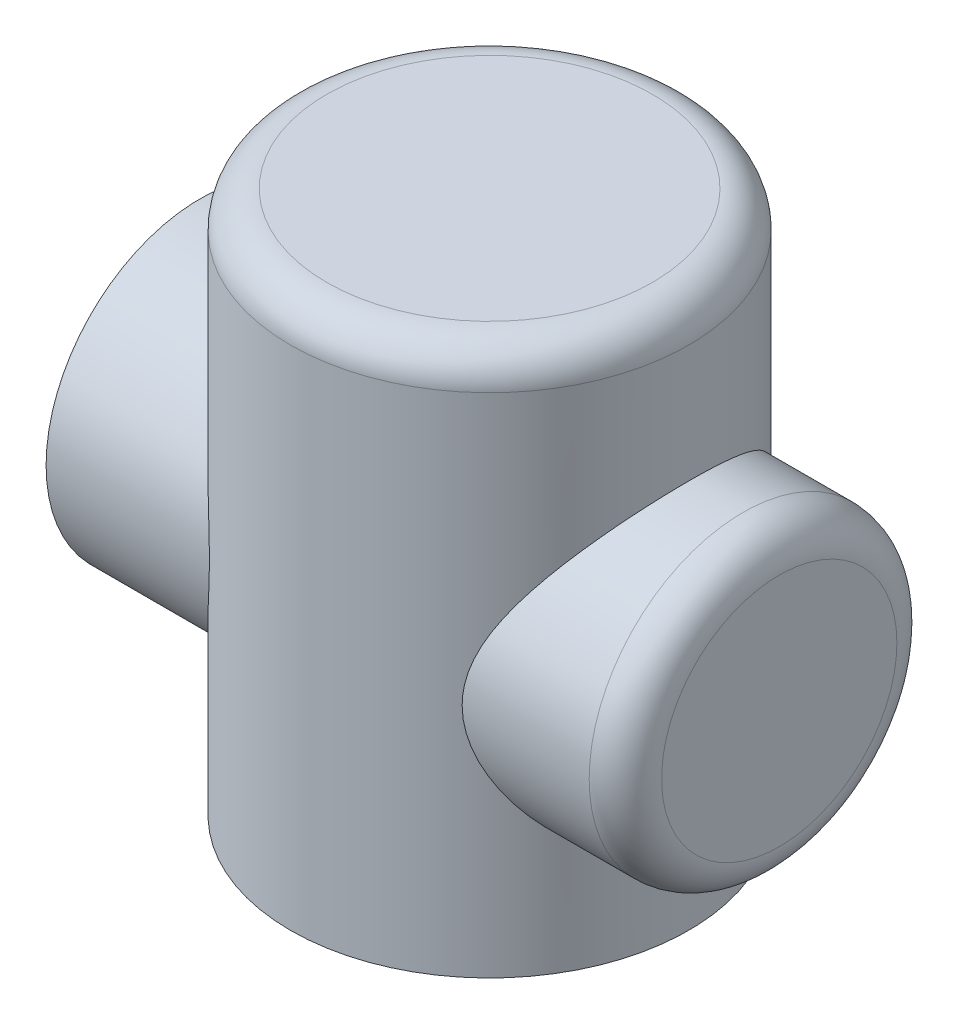
ISO-10303-21;
HEADER;
FILE_DESCRIPTION(('STEP AP214'),'2;1');
FILE_NAME('part.step','',(''),(''),'','','');
FILE_SCHEMA(('AUTOMOTIVE_DESIGN { 1 0 10303 214 1 1 1 1 }'));
ENDSEC;
DATA;
#1=APPLICATION_CONTEXT('core data for automotive mechanical design processes');
#2=APPLICATION_PROTOCOL_DEFINITION('international standard','automotive_design',2000,#1);
#3=PRODUCT_CONTEXT('',#1,'mechanical');
#4=PRODUCT('Part','Part','',(#3));
#5=PRODUCT_RELATED_PRODUCT_CATEGORY('part','',(#4));
#6=PRODUCT_DEFINITION_FORMATION('','',#4);
#7=PRODUCT_DEFINITION_CONTEXT('part definition',#1,'design');
#8=PRODUCT_DEFINITION('design','',#6,#7);
#9=PRODUCT_DEFINITION_SHAPE('','',#8);
#10=(LENGTH_UNIT() NAMED_UNIT(*) SI_UNIT(.MILLI.,.METRE.));
#11=(NAMED_UNIT(*) PLANE_ANGLE_UNIT() SI_UNIT($,.RADIAN.));
#12=(NAMED_UNIT(*) SI_UNIT($,.STERADIAN.) SOLID_ANGLE_UNIT());
#13=UNCERTAINTY_MEASURE_WITH_UNIT(LENGTH_MEASURE(1.E-05),#10,'distance_accuracy_value','');
#14=(GEOMETRIC_REPRESENTATION_CONTEXT(3) GLOBAL_UNCERTAINTY_ASSIGNED_CONTEXT((#13)) GLOBAL_UNIT_ASSIGNED_CONTEXT((#10,
#11,#12)) REPRESENTATION_CONTEXT('',''));
#15=CARTESIAN_POINT('',(0.,0.,0.));
#16=DIRECTION('',(0.,0.,1.));
#17=DIRECTION('',(1.,0.,0.));
#18=AXIS2_PLACEMENT_3D('',#15,#16,#17);
#19=CARTESIAN_POINT('',(0.,150.,0.));
#20=DIRECTION('',(0.,-1.,0.));
#21=DIRECTION('',(0.,0.,-1.));
#22=AXIS2_PLACEMENT_3D('',#19,#20,#21);
#23=CYLINDRICAL_SURFACE('',#22,55.);
#24=CARTESIAN_POINT('',(0.,140.,0.));
#25=DIRECTION('',(0.,1.,0.));
#26=DIRECTION('',(0.,0.,1.));
#27=AXIS2_PLACEMENT_3D('',#24,#25,#26);
#28=CIRCLE('',#27,55.);
#29=CARTESIAN_POINT('',(0.,140.,55.));
#30=VERTEX_POINT('',#29);
#31=EDGE_CURVE('E74',#30,#30,#28,.F.);
#32=ORIENTED_EDGE('',*,*,#31,.T.);
#33=EDGE_LOOP('',(#32));
#34=FACE_BOUND('',#33,.T.);
#35=CARTESIAN_POINT('',(0.,0.,0.));
#36=DIRECTION('',(0.,1.,0.));
#37=DIRECTION('',(0.,0.,1.));
#38=AXIS2_PLACEMENT_3D('',#35,#36,#37);
#39=CIRCLE('',#38,55.);
#40=CARTESIAN_POINT('',(0.,0.,55.));
#41=VERTEX_POINT('',#40);
#42=EDGE_CURVE('E118',#41,#41,#39,.T.);
#43=ORIENTED_EDGE('',*,*,#42,.T.);
#44=EDGE_LOOP('',(#43));
#45=FACE_BOUND('',#44,.T.);
#46=CARTESIAN_POINT('',(-34.9106001094223,65.,42.5));
#47=CARTESIAN_POINT('',(-34.9105997851786,65.4891449843264,42.5000002288912));
#48=CARTESIAN_POINT('',(-34.9208955316221,65.9782939303529,42.4915493792357));
#49=CARTESIAN_POINT('',(-34.9619001599965,66.9551568815526,42.457817106543));
#50=CARTESIAN_POINT('',(-34.9926095770876,67.44287084877,42.4325352422677));
#51=CARTESIAN_POINT('',(-35.0739342720024,68.4155049460207,42.3653387466732));
#52=CARTESIAN_POINT('',(-35.1245502921923,68.9004249711767,42.3234234950536));
#53=CARTESIAN_POINT('',(-35.2448610571616,69.8662194110095,42.2232851714191));
#54=CARTESIAN_POINT('',(-35.3145586980467,70.3470932001417,42.1650596238841));
#55=CARTESIAN_POINT('',(-35.5512536730363,71.7849782019962,41.9660754884727));
#56=CARTESIAN_POINT('',(-35.7456011158555,72.7343580064285,41.8012124811986));
#57=CARTESIAN_POINT('',(-36.1964682107257,74.605230788093,41.4113987075601));
#58=CARTESIAN_POINT('',(-36.4529977494698,75.526719304493,41.1864383853928));
#59=CARTESIAN_POINT('',(-37.077660706149,77.5339047626655,40.625839626523));
#60=CARTESIAN_POINT('',(-37.4579319519364,78.6120680336423,40.2767899053382));
#61=CARTESIAN_POINT('',(-38.2737974254088,80.7187150287624,39.502312406044));
#62=CARTESIAN_POINT('',(-38.7094081628024,81.7471838003834,39.0768618191511));
#63=CARTESIAN_POINT('',(-39.6192021057817,83.7545230170705,38.1541475858732));
#64=CARTESIAN_POINT('',(-40.0934161782856,84.7333527358697,37.6568262209241));
#65=CARTESIAN_POINT('',(-41.0656968927172,86.6405718331285,36.5940886947428));
#66=CARTESIAN_POINT('',(-41.5637612823182,87.5689659569154,36.0286789558901));
#67=CARTESIAN_POINT('',(-42.5849452621606,89.3991636008043,34.8161911063448));
#68=CARTESIAN_POINT('',(-43.1083793188185,90.2996270102167,34.1673571583866));
#69=CARTESIAN_POINT('',(-44.1564155957314,92.0467618949143,32.8017071071619));
#70=CARTESIAN_POINT('',(-44.6810178587349,92.8934313670834,32.0848884748354));
#71=CARTESIAN_POINT('',(-45.7209427029055,94.5305572948476,30.5847654803963));
#72=CARTESIAN_POINT('',(-46.2362713509327,95.3210515789884,29.8015066541491));
#73=CARTESIAN_POINT('',(-47.2486214887345,96.8434494585851,28.1689583325873));
#74=CARTESIAN_POINT('',(-47.7456440580623,97.575356512066,27.3196727402465));
#75=CARTESIAN_POINT('',(-48.6912095230291,98.945822343589,25.594741173882));
#76=CARTESIAN_POINT('',(-49.1409219510165,99.5870634828419,24.72187161527));
#77=CARTESIAN_POINT('',(-50.007535260636,100.807656258381,22.9182735623926));
#78=CARTESIAN_POINT('',(-50.4244356490151,101.387006964334,21.9875441987151));
#79=CARTESIAN_POINT('',(-51.217301799851,102.47802394852,20.0714287908287));
#80=CARTESIAN_POINT('',(-51.5932953912362,102.98973629277,19.0860806014535));
#81=CARTESIAN_POINT('',(-52.2968713559347,103.939885744194,17.0640681321183));
#82=CARTESIAN_POINT('',(-52.6244618743697,104.378335181457,16.0274125252987));
#83=CARTESIAN_POINT('',(-53.1783562571218,105.11529948507,14.0689559091465));
#84=CARTESIAN_POINT('',(-53.4124861195881,105.424951071134,13.1535489443157));
#85=CARTESIAN_POINT('',(-53.8363088428573,105.983304166828,11.2942726185532));
#86=CARTESIAN_POINT('',(-54.026005923523,106.232011464553,10.3504059701077));
#87=CARTESIAN_POINT('',(-54.3571797125297,106.665002526401,8.440152075847));
#88=CARTESIAN_POINT('',(-54.4986801770982,106.849318030548,7.47377617658783));
#89=CARTESIAN_POINT('',(-54.730640675359,107.150947051705,5.52451086864479));
#90=CARTESIAN_POINT('',(-54.8211001312332,107.2682598102,4.54162127314463));
#91=CARTESIAN_POINT('',(-54.9491808198944,107.434246529204,2.5636885701714));
#92=CARTESIAN_POINT('',(-54.9866459443309,107.482717700921,1.56861822921809));
#93=CARTESIAN_POINT('',(-55.0073886621494,107.509562236798,-0.423039341332993));
#94=CARTESIAN_POINT('',(-54.9906661455108,107.487935458632,-1.41962657400649));
#95=CARTESIAN_POINT('',(-54.9034096745232,107.374941585768,-3.40656238673648));
#96=CARTESIAN_POINT('',(-54.8328694358445,107.283566346495,-4.39691022459699));
#97=CARTESIAN_POINT('',(-54.6395432558043,107.03255987222,-6.36370590413459));
#98=CARTESIAN_POINT('',(-54.5167580591416,106.872929610124,-7.34015394373414));
#99=CARTESIAN_POINT('',(-54.2280279248772,106.496300395108,-9.2301000257284));
#100=CARTESIAN_POINT('',(-54.0641998867619,106.282108450803,-10.1444857875692));
#101=CARTESIAN_POINT('',(-53.6942155727445,105.796366817344,-11.9490403604779));
#102=CARTESIAN_POINT('',(-53.4880608533747,105.52481923739,-12.8392100607105));
#103=CARTESIAN_POINT('',(-53.0369496202634,104.927513584394,-14.5911042584072));
#104=CARTESIAN_POINT('',(-52.791989029187,104.60174981467,-15.4528257553072));
#105=CARTESIAN_POINT('',(-52.2671744266677,103.899382827112,-17.1442933501702));
#106=CARTESIAN_POINT('',(-51.9873183365002,103.522776580481,-17.9740375393873));
#107=CARTESIAN_POINT('',(-51.3659386528833,102.680219038676,-19.6837958371438));
#108=CARTESIAN_POINT('',(-51.0210269275216,102.209043899619,-20.5600030565746));
#109=CARTESIAN_POINT('',(-50.299264721007,101.213033840974,-22.2675406540159));
#110=CARTESIAN_POINT('',(-49.9224123726884,100.688195784022,-23.0988684038329));
#111=CARTESIAN_POINT('',(-49.1422236946961,99.5884156820301,-24.7153332647529));
#112=CARTESIAN_POINT('',(-48.7388726133643,99.0134456696104,-25.5004441782203));
#113=CARTESIAN_POINT('',(-47.9115579848606,97.8169795483925,-27.0228293792587));
#114=CARTESIAN_POINT('',(-47.487593462658,97.19548123802,-27.7601014001569));
#115=CARTESIAN_POINT('',(-46.5373693848213,95.7783477350251,-29.3304821825735));
#116=CARTESIAN_POINT('',(-46.0077784030319,94.9729330412174,-30.1527706068329));
#117=CARTESIAN_POINT('',(-44.9372175215653,93.3022098910415,-31.7262057612385));
#118=CARTESIAN_POINT('',(-44.3962455616245,92.4368905242271,-32.477339472655));
#119=CARTESIAN_POINT('',(-43.3135022961492,90.6479460113039,-33.9079008374094));
#120=CARTESIAN_POINT('',(-42.7717306980876,89.7242741971617,-34.5872699056561));
#121=CARTESIAN_POINT('',(-41.7001287343741,87.8203893907003,-35.8719733800113));
#122=CARTESIAN_POINT('',(-41.170296237502,86.8401866025813,-36.4773210862751));
#123=CARTESIAN_POINT('',(-40.2220436202053,84.9896300508913,-37.517968655817));
#124=CARTESIAN_POINT('',(-39.7996579049517,84.1278128186682,-37.9648492101727));
#125=CARTESIAN_POINT('',(-38.9828980831988,82.3645305959695,-38.8030403799898));
#126=CARTESIAN_POINT('',(-38.5885249178945,81.4630642749686,-39.1943491287326));
#127=CARTESIAN_POINT('',(-37.839932930076,79.622449580056,-39.9175389259675));
#128=CARTESIAN_POINT('',(-37.485642758672,78.6833723232868,-40.2495261990121));
#129=CARTESIAN_POINT('',(-36.8295424232636,76.7674970009388,-40.8507404541482));
#130=CARTESIAN_POINT('',(-36.5277148576057,75.7907115749055,-41.1199882568229));
#131=CARTESIAN_POINT('',(-36.054853975055,74.0406164879871,-41.5345815990419));
#132=CARTESIAN_POINT('',(-35.8698008029623,73.2744569528828,-41.6941603323236));
#133=CARTESIAN_POINT('',(-35.544424338069,71.7252614638154,-41.9718928045791));
#134=CARTESIAN_POINT('',(-35.4040950055495,70.9422278038747,-42.0900521372401));
#135=CARTESIAN_POINT('',(-35.1737348044515,69.3645691145434,-42.2827511759414));
#136=CARTESIAN_POINT('',(-35.0836317601953,68.5699624106576,-42.3573534812163));
#137=CARTESIAN_POINT('',(-34.9572837445148,66.9734882060508,-42.4616901072443));
#138=CARTESIAN_POINT('',(-34.9210385374211,66.1716207371166,-42.4914246243284));
#139=CARTESIAN_POINT('',(-34.9040453977496,64.5648238250787,-42.5053850426105));
#140=CARTESIAN_POINT('',(-34.9234406974643,63.7598918159341,-42.4894934910472));
#141=CARTESIAN_POINT('',(-35.0171357291868,62.1554746764269,-42.4123072502091));
#142=CARTESIAN_POINT('',(-35.0914353859403,61.3559895386,-42.3510126231658));
#143=CARTESIAN_POINT('',(-35.2917822760301,59.767224439033,-42.1842029453717));
#144=CARTESIAN_POINT('',(-35.4178960642378,58.9779589543438,-42.0786310171087));
#145=CARTESIAN_POINT('',(-35.7167972394694,57.4152562855602,-41.8252151915092));
#146=CARTESIAN_POINT('',(-35.8895915716234,56.6418214751882,-41.6773650038227));
#147=CARTESIAN_POINT('',(-36.3392929742949,54.8630262685203,-41.2864540274045));
#148=CARTESIAN_POINT('',(-36.6317541295531,53.864950929114,-41.0280714692369));
#149=CARTESIAN_POINT('',(-37.2735875059239,51.9069760307104,-40.4458536693613));
#150=CARTESIAN_POINT('',(-37.6229803522897,50.9470904645177,-40.121994696536));
#151=CARTESIAN_POINT('',(-38.3656134386276,49.0651388385763,-39.4124859714239));
#152=CARTESIAN_POINT('',(-38.758960411771,48.1431726169948,-39.0266847690216));
#153=CARTESIAN_POINT('',(-39.5765363675372,46.3399292143169,-38.1973396307715));
#154=CARTESIAN_POINT('',(-40.0007656718762,45.4586524572587,-37.7537950933455));
#155=CARTESIAN_POINT('',(-40.7268929652843,44.0195656140527,-36.9662771061941));
#156=CARTESIAN_POINT('',(-41.0232163817058,43.4505660307944,-36.6374349767592));
#157=CARTESIAN_POINT('',(-41.6223140325529,42.3308440161427,-35.9553766684857));
#158=CARTESIAN_POINT('',(-41.9250886769488,41.7801227520443,-35.6021589373847));
#159=CARTESIAN_POINT('',(-42.8393677482624,40.1551780535227,-34.5064155517986));
#160=CARTESIAN_POINT('',(-43.4567835402314,39.1082589430389,-33.7278464736522));
#161=CARTESIAN_POINT('',(-44.6886812058769,37.0900407442823,-32.0777539257044));
#162=CARTESIAN_POINT('',(-45.3031644817889,36.1187011935475,-31.2062807938561));
#163=CARTESIAN_POINT('',(-46.5136833701092,34.2546810121845,-29.3714911273789));
#164=CARTESIAN_POINT('',(-47.109724236518,33.3619778427068,-28.4082010753148));
#165=CARTESIAN_POINT('',(-48.1704448481396,31.8049906693221,-26.5620447442271));
#166=CARTESIAN_POINT('',(-48.6402848971226,31.1276172813316,-25.6931559813476));
#167=CARTESIAN_POINT('',(-49.5487098496071,29.8355904310307,-23.8943556587282));
#168=CARTESIAN_POINT('',(-49.9872958519696,29.2209347632996,-22.9644462466237));
#169=CARTESIAN_POINT('',(-50.8243118571386,28.0605651875898,-21.0471403281284));
#170=CARTESIAN_POINT('',(-51.2227928257231,27.5147635498711,-20.0598193654954));
#171=CARTESIAN_POINT('',(-51.9719144140954,26.4974242542895,-18.0302370523762));
#172=CARTESIAN_POINT('',(-52.3225630715474,26.0258741172642,-16.9879849733342));
#173=CARTESIAN_POINT('',(-52.9158834491261,25.2332038469997,-15.0260992001813));
#174=CARTESIAN_POINT('',(-53.1668486930162,24.9000880285474,-14.1138078102259));
#175=CARTESIAN_POINT('',(-53.6249967353162,24.2946011931349,-12.2585593585735));
#176=CARTESIAN_POINT('',(-53.8321840167727,24.0222239561314,-11.3156054482693));
#177=CARTESIAN_POINT('',(-54.1986972401111,23.5419142776623,-9.40464298303723));
#178=CARTESIAN_POINT('',(-54.3580412959979,23.3339574449295,-8.43664406159897));
#179=CARTESIAN_POINT('',(-54.6256598599935,22.9854168543863,-6.48156234335329));
#180=CARTESIAN_POINT('',(-54.7339337454892,22.844833917953,-5.49447931403796));
#181=CARTESIAN_POINT('',(-54.8973070486375,22.6329266523664,-3.50502362873868));
#182=CARTESIAN_POINT('',(-54.9522211308231,22.5618437134073,-2.50260987888928));
#183=CARTESIAN_POINT('',(-55.0069614539599,22.4909854407451,-0.493748792290085));
#184=CARTESIAN_POINT('',(-55.0067875949558,22.4912102364275,0.51269855177521));
#185=CARTESIAN_POINT('',(-54.9513562197786,22.562963549799,2.52154087716585));
#186=CARTESIAN_POINT('',(-54.8960968723393,22.6344944379932,3.52393572265728));
#187=CARTESIAN_POINT('',(-54.7317566995921,22.8476596430032,5.51673467352629));
#188=CARTESIAN_POINT('',(-54.6226771146821,22.9892923441789,6.50713905470981));
#189=CARTESIAN_POINT('',(-54.3604116543332,23.3308792599012,8.41563515634278));
#190=CARTESIAN_POINT('',(-54.2099272693806,23.5272689057099,9.33474270210209));
#191=CARTESIAN_POINT('',(-53.8658076806591,23.9780980264884,11.1502643764457));
#192=CARTESIAN_POINT('',(-53.6721743941507,24.2325349222225,12.0466795113651));
#193=CARTESIAN_POINT('',(-53.2451305484176,24.7964202764616,13.8123596026901));
#194=CARTESIAN_POINT('',(-53.0117154387658,25.1058750283361,14.6816214397027));
#195=CARTESIAN_POINT('',(-52.5089126749995,25.7764723426703,16.3892176622093));
#196=CARTESIAN_POINT('',(-52.2395228986771,26.1376179545538,17.2275502194049));
#197=CARTESIAN_POINT('',(-51.6420054665057,26.9444222721941,18.9475063091979));
#198=CARTESIAN_POINT('',(-51.3107379993337,27.3948316226281,19.8258088341393));
#199=CARTESIAN_POINT('',(-50.6154089925646,28.3492632881737,21.5391589454668));
#200=CARTESIAN_POINT('',(-50.2513457636067,28.8532883653571,22.3742043001148));
#201=CARTESIAN_POINT('',(-49.4957278598707,29.9113363179539,23.999509199662));
#202=CARTESIAN_POINT('',(-49.1041602285745,30.4653827925238,24.7897473161003));
#203=CARTESIAN_POINT('',(-48.2991748466065,31.6198935920096,26.3237569293406));
#204=CARTESIAN_POINT('',(-47.8857560086183,32.2203602274822,27.0675261098221));
#205=CARTESIAN_POINT('',(-46.9587378664033,33.5886246133144,28.6509573580584));
#206=CARTESIAN_POINT('',(-46.4415581106479,34.3659603571031,29.480298945342));
#207=CARTESIAN_POINT('',(-45.3933418977294,35.9796277390605,31.0701027091918));
#208=CARTESIAN_POINT('',(-44.8623031662621,36.8159690990964,31.8305534878249));
#209=CARTESIAN_POINT('',(-43.7961985858952,38.5458580389641,33.2821953978981));
#210=CARTESIAN_POINT('',(-43.2611295962358,39.4394554592402,33.9733248062038));
#211=CARTESIAN_POINT('',(-42.198768040696,41.2818056779487,35.2842083300915));
#212=CARTESIAN_POINT('',(-41.6714744740866,42.2305512995175,35.903971701936));
#213=CARTESIAN_POINT('',(-40.6996494906342,44.0657645324802,37.0001203060926));
#214=CARTESIAN_POINT('',(-40.2527782799644,44.9460487190281,37.4847864890803));
#215=CARTESIAN_POINT('',(-39.3854163248202,46.7493557372556,38.3951051836026));
#216=CARTESIAN_POINT('',(-38.9649266506376,47.6723803002638,38.8207553017178));
#217=CARTESIAN_POINT('',(-38.1630433572948,49.5598953535202,39.6093170099397));
#218=CARTESIAN_POINT('',(-37.7816022450413,50.5243333969995,39.9723051910933));
#219=CARTESIAN_POINT('',(-37.0714448177416,52.4945870275736,40.6317973431999));
#220=CARTESIAN_POINT('',(-36.7427143196034,53.5003913922056,40.9283192071307));
#221=CARTESIAN_POINT('',(-36.2080066033364,55.3610036216762,41.4014899159746));
#222=CARTESIAN_POINT('',(-35.9905715704425,56.2094470061722,41.5901609644238));
#223=CARTESIAN_POINT('',(-35.6098429311225,57.928038791448,41.9166090800101));
#224=CARTESIAN_POINT('',(-35.4465406479408,58.7981836897009,42.0543943038685));
#225=CARTESIAN_POINT('',(-35.1820884825305,60.5527194490202,42.2758893719668));
#226=CARTESIAN_POINT('',(-35.0807845832094,61.4370693608229,42.3597332447172));
#227=CARTESIAN_POINT('',(-34.9789438049603,62.7698366572662,42.4437872790948));
#228=CARTESIAN_POINT('',(-34.953349289984,63.2152200936565,42.4648533658333));
#229=CARTESIAN_POINT('',(-34.9191785088844,64.1070680011322,42.4929588646263));
#230=CARTESIAN_POINT('',(-34.9106004053762,64.5535323502909,42.4999997910793));
#231=CARTESIAN_POINT('',(-34.9106001094223,65.,42.5));
#232=B_SPLINE_CURVE_WITH_KNOTS('',3,(#46,#47,#48,#49,#50,#51,#52,#53,#54,#55,#56,#57,#58,#59,
#60,#61,#62,#63,#64,#65,#66,#67,#68,#69,#70,#71,#72,#73,#74,#75,#76,#77,#78,#79,#80,#81,#82,#83,
#84,#85,#86,#87,#88,#89,#90,#91,#92,#93,#94,#95,#96,#97,#98,#99,#100,#101,#102,#103,#104,#105,
#106,#107,#108,#109,#110,#111,#112,#113,#114,#115,#116,#117,#118,#119,#120,#121,#122,#123,#124,
#125,#126,#127,#128,#129,#130,#131,#132,#133,#134,#135,#136,#137,#138,#139,#140,#141,#142,#143,
#144,#145,#146,#147,#148,#149,#150,#151,#152,#153,#154,#155,#156,#157,#158,#159,#160,#161,#162,
#163,#164,#165,#166,#167,#168,#169,#170,#171,#172,#173,#174,#175,#176,#177,#178,#179,#180,#181,
#182,#183,#184,#185,#186,#187,#188,#189,#190,#191,#192,#193,#194,#195,#196,#197,#198,#199,#200,
#201,#202,#203,#204,#205,#206,#207,#208,#209,#210,#211,#212,#213,#214,#215,#216,#217,#218,#219,
#220,#221,#222,#223,#224,#225,#226,#227,#228,#229,#230,#231),.UNSPECIFIED.,.T.,.F.,(4,2,2,2,2,2,
2,2,2,2,2,2,2,2,2,2,2,2,2,2,2,2,2,2,2,2,2,2,2,2,2,2,2,2,2,2,2,2,2,2,2,2,2,2,2,2,2,2,2,2,2,2,2,2,
2,2,2,2,2,2,2,2,2,2,2,2,2,2,2,2,2,2,2,2,2,2,2,2,2,2,2,2,2,2,2,2,2,2,2,2,2,2,4),(0.,
1.46726072876536,2.93455992442403,4.40191384447285,5.86949059518676,8.81334224057231,
11.7576622534266,15.338077768014,18.9195639655034,22.5039425623606,26.0879833301006,
29.7662186314789,33.4445908185378,37.1204620335439,40.7961161254391,44.3110493456528,
47.8260353946815,51.3386150428796,54.8506029300266,57.8305081307339,60.8101302095211,
63.7882814929021,66.7664664902562,69.7534063514732,72.7403522772671,75.7276470440363,
78.7148992313838,81.5718115660531,84.4286188587187,87.2857265156149,90.1430044517773,
93.2988466244722,96.4548734068978,99.612672264151,102.770620633176,106.567968132271,
110.366009071618,114.167126963974,117.967560864886,121.141357504549,124.315260730355,
127.483422343717,130.650531075769,133.060870695186,135.470884672879,137.877426449219,
140.283957695063,142.696689496426,145.109417990802,147.525255354812,149.941452345179,
153.15145332436,156.362619821126,159.581760727151,162.800935173331,164.963004708631,
167.125212053947,171.449945565368,175.772347614526,180.093506713136,183.683393120231,
187.273153248174,190.858292300084,194.442828166945,197.449117017713,200.45509786256,
203.459939168593,206.464817106685,209.480095020533,212.495378405501,215.510762034122,
218.526076170282,221.378472990296,224.230743093345,227.083339671349,229.936104603371,
233.056601057513,236.177258345305,239.29939567177,242.421688502346,246.164523700657,
249.907977021617,253.654734430697,257.401005332069,260.697840397646,263.994809128556,
267.287719027346,270.57974139517,273.264602494529,275.949033038248,278.626767528987,
279.966156086105,281.305400011879),.UNSPECIFIED.);
#233=CARTESIAN_POINT('',(-34.9106001094223,65.,42.5));
#234=VERTEX_POINT('',#233);
#235=EDGE_CURVE('E65',#234,#234,#232,.T.);
#236=ORIENTED_EDGE('',*,*,#235,.F.);
#237=EDGE_LOOP('',(#236));
#238=FACE_BOUND('',#237,.T.);
#239=CARTESIAN_POINT('',(34.9106001094223,65.,42.5));
#240=CARTESIAN_POINT('',(34.9105997851786,64.5108550156736,42.5000002288912));
#241=CARTESIAN_POINT('',(34.9208955316221,64.0217060696471,42.4915493792357));
#242=CARTESIAN_POINT('',(34.9619001599965,63.0448431184474,42.457817106543));
#243=CARTESIAN_POINT('',(34.9926095770876,62.55712915123,42.4325352422677));
#244=CARTESIAN_POINT('',(35.0739342720024,61.5844950539793,42.3653387466732));
#245=CARTESIAN_POINT('',(35.1245502921923,61.0995750288233,42.3234234950536));
#246=CARTESIAN_POINT('',(35.2448610571616,60.1337805889906,42.2232851714191));
#247=CARTESIAN_POINT('',(35.3145586980467,59.6529067998583,42.1650596238841));
#248=CARTESIAN_POINT('',(35.5512536730363,58.2150217980038,41.9660754884727));
#249=CARTESIAN_POINT('',(35.7456011158555,57.2656419935715,41.8012124811986));
#250=CARTESIAN_POINT('',(36.1964682107257,55.394769211907,41.4113987075601));
#251=CARTESIAN_POINT('',(36.4529977494698,54.473280695507,41.1864383853928));
#252=CARTESIAN_POINT('',(37.077660706149,52.4660952373345,40.625839626523));
#253=CARTESIAN_POINT('',(37.4579319519364,51.3879319663577,40.2767899053382));
#254=CARTESIAN_POINT('',(38.2737974254088,49.2812849712376,39.502312406044));
#255=CARTESIAN_POINT('',(38.7094081628024,48.2528161996166,39.0768618191511));
#256=CARTESIAN_POINT('',(39.6192021057817,46.2454769829295,38.1541475858732));
#257=CARTESIAN_POINT('',(40.0934161782856,45.2666472641303,37.6568262209241));
#258=CARTESIAN_POINT('',(41.0656968927172,43.3594281668715,36.5940886947428));
#259=CARTESIAN_POINT('',(41.5637612823181,42.4310340430846,36.0286789558901));
#260=CARTESIAN_POINT('',(42.5849452621606,40.6008363991958,34.8161911063448));
#261=CARTESIAN_POINT('',(43.1083793188185,39.7003729897834,34.1673571583866));
#262=CARTESIAN_POINT('',(44.1564155957314,37.9532381050857,32.8017071071619));
#263=CARTESIAN_POINT('',(44.6810178587349,37.1065686329166,32.0848884748354));
#264=CARTESIAN_POINT('',(45.7209427029055,35.4694427051524,30.5847654803963));
#265=CARTESIAN_POINT('',(46.2362713509327,34.6789484210116,29.8015066541491));
#266=CARTESIAN_POINT('',(47.2486214887345,33.1565505414149,28.1689583325873));
#267=CARTESIAN_POINT('',(47.7456440580624,32.424643487934,27.3196727402465));
#268=CARTESIAN_POINT('',(48.6912095230291,31.054177656411,25.594741173882));
#269=CARTESIAN_POINT('',(49.1409219510165,30.4129365171581,24.72187161527));
#270=CARTESIAN_POINT('',(50.0075352606361,29.1923437416189,22.9182735623926));
#271=CARTESIAN_POINT('',(50.4244356490151,28.6129930356655,21.9875441987151));
#272=CARTESIAN_POINT('',(51.217301799851,27.5219760514804,20.0714287908287));
#273=CARTESIAN_POINT('',(51.5932953912362,27.0102637072304,19.0860806014535));
#274=CARTESIAN_POINT('',(52.2968713559347,26.0601142558058,17.0640681321183));
#275=CARTESIAN_POINT('',(52.6244618743697,25.6216648185431,16.0274125252987));
#276=CARTESIAN_POINT('',(53.1783562571218,24.8847005149305,14.0689559091464));
#277=CARTESIAN_POINT('',(53.4124861195881,24.5750489288662,13.1535489443157));
#278=CARTESIAN_POINT('',(53.8363088428573,24.0166958331718,11.2942726185532));
#279=CARTESIAN_POINT('',(54.026005923523,23.7679885354473,10.3504059701077));
#280=CARTESIAN_POINT('',(54.3571797125297,23.334997473599,8.44015207584698));
#281=CARTESIAN_POINT('',(54.4986801770982,23.1506819694525,7.47377617658781));
#282=CARTESIAN_POINT('',(54.730640675359,22.8490529482951,5.52451086864477));
#283=CARTESIAN_POINT('',(54.8211001312332,22.7317401897997,4.54162127314461));
#284=CARTESIAN_POINT('',(54.9491808198944,22.5657534707959,2.56368857017138));
#285=CARTESIAN_POINT('',(54.9866459443309,22.5172822990786,1.56861822921806));
#286=CARTESIAN_POINT('',(55.0073886621494,22.4904377632023,-0.423039341333025));
#287=CARTESIAN_POINT('',(54.9906661455108,22.5120645413676,-1.41962657400652));
#288=CARTESIAN_POINT('',(54.9034096745233,22.6250584142325,-3.40656238673651));
#289=CARTESIAN_POINT('',(54.8328694358445,22.7164336535051,-4.39691022459702));
#290=CARTESIAN_POINT('',(54.6395432558043,22.96744012778,-6.36370590413462));
#291=CARTESIAN_POINT('',(54.5167580591416,23.1270703898765,-7.34015394373417));
#292=CARTESIAN_POINT('',(54.2280279248772,23.5036996048922,-9.23010002572843));
#293=CARTESIAN_POINT('',(54.0641998867618,23.7178915491975,-10.1444857875692));
#294=CARTESIAN_POINT('',(53.6942155727445,24.2036331826562,-11.9490403604779));
#295=CARTESIAN_POINT('',(53.4880608533746,24.4751807626096,-12.8392100607106));
#296=CARTESIAN_POINT('',(53.0369496202634,25.0724864156064,-14.5911042584072));
#297=CARTESIAN_POINT('',(52.791989029187,25.39825018533,-15.4528257553072));
#298=CARTESIAN_POINT('',(52.2671744266677,26.100617172888,-17.1442933501702));
#299=CARTESIAN_POINT('',(51.9873183365002,26.477223419519,-17.9740375393873));
#300=CARTESIAN_POINT('',(51.3659386528833,27.3197809613244,-19.6837958371438));
#301=CARTESIAN_POINT('',(51.0210269275216,27.7909561003815,-20.5600030565747));
#302=CARTESIAN_POINT('',(50.299264721007,28.7869661590258,-22.267540654016));
#303=CARTESIAN_POINT('',(49.9224123726883,29.3118042159782,-23.0988684038329));
#304=CARTESIAN_POINT('',(49.1422236946961,30.4115843179699,-24.7153332647529));
#305=CARTESIAN_POINT('',(48.7388726133643,30.9865543303897,-25.5004441782203));
#306=CARTESIAN_POINT('',(47.9115579848606,32.1830204516075,-27.0228293792587));
#307=CARTESIAN_POINT('',(47.487593462658,32.80451876198,-27.7601014001569));
#308=CARTESIAN_POINT('',(46.5373693848213,34.2216522649749,-29.3304821825736));
#309=CARTESIAN_POINT('',(46.0077784030319,35.0270669587826,-30.1527706068329));
#310=CARTESIAN_POINT('',(44.9372175215653,36.6977901089585,-31.7262057612385));
#311=CARTESIAN_POINT('',(44.3962455616244,37.563109475773,-32.477339472655));
#312=CARTESIAN_POINT('',(43.3135022961492,39.3520539886962,-33.9079008374094));
#313=CARTESIAN_POINT('',(42.7717306980876,40.2757258028383,-34.5872699056562));
#314=CARTESIAN_POINT('',(41.7001287343741,42.1796106092998,-35.8719733800114));
#315=CARTESIAN_POINT('',(41.170296237502,43.1598133974187,-36.4773210862751));
#316=CARTESIAN_POINT('',(40.2220436202053,45.0103699491087,-37.517968655817));
#317=CARTESIAN_POINT('',(39.7996579049516,45.8721871813319,-37.9648492101728));
#318=CARTESIAN_POINT('',(38.9828980831988,47.6354694040306,-38.8030403799898));
#319=CARTESIAN_POINT('',(38.5885249178945,48.5369357250315,-39.1943491287326));
#320=CARTESIAN_POINT('',(37.839932930076,50.3775504199441,-39.9175389259675));
#321=CARTESIAN_POINT('',(37.485642758672,51.3166276767132,-40.2495261990121));
#322=CARTESIAN_POINT('',(36.8295424232635,53.2325029990613,-40.8507404541482));
#323=CARTESIAN_POINT('',(36.5277148576057,54.2092884250945,-41.1199882568229));
#324=CARTESIAN_POINT('',(36.054853975055,55.9593835120129,-41.5345815990419));
#325=CARTESIAN_POINT('',(35.8698008029623,56.7255430471172,-41.6941603323237));
#326=CARTESIAN_POINT('',(35.544424338069,58.2747385361847,-41.9718928045791));
#327=CARTESIAN_POINT('',(35.4040950055495,59.0577721961253,-42.0900521372401));
#328=CARTESIAN_POINT('',(35.1737348044515,60.6354308854567,-42.2827511759414));
#329=CARTESIAN_POINT('',(35.0836317601953,61.4300375893424,-42.3573534812163));
#330=CARTESIAN_POINT('',(34.9572837445148,63.0265117939493,-42.4616901072443));
#331=CARTESIAN_POINT('',(34.9210385374211,63.8283792628835,-42.4914246243284));
#332=CARTESIAN_POINT('',(34.9040453977496,65.4351761749214,-42.5053850426105));
#333=CARTESIAN_POINT('',(34.9234406974643,66.240108184066,-42.4894934910472));
#334=CARTESIAN_POINT('',(35.0171357291868,67.8445253235732,-42.4123072502091));
#335=CARTESIAN_POINT('',(35.0914353859403,68.6440104614,-42.3510126231658));
#336=CARTESIAN_POINT('',(35.2917822760301,70.2327755609671,-42.1842029453717));
#337=CARTESIAN_POINT('',(35.4178960642378,71.0220410456563,-42.0786310171087));
#338=CARTESIAN_POINT('',(35.7167972394694,72.5847437144399,-41.8252151915092));
#339=CARTESIAN_POINT('',(35.8895915716234,73.3581785248119,-41.6773650038227));
#340=CARTESIAN_POINT('',(36.3392929742949,75.1369737314797,-41.2864540274045));
#341=CARTESIAN_POINT('',(36.6317541295531,76.135049070886,-41.0280714692369));
#342=CARTESIAN_POINT('',(37.2735875059239,78.0930239692896,-40.4458536693613));
#343=CARTESIAN_POINT('',(37.6229803522897,79.0529095354823,-40.121994696536));
#344=CARTESIAN_POINT('',(38.3656134386276,80.9348611614238,-39.4124859714239));
#345=CARTESIAN_POINT('',(38.758960411771,81.8568273830052,-39.0266847690216));
#346=CARTESIAN_POINT('',(39.5765363675372,83.6600707856832,-38.1973396307715));
#347=CARTESIAN_POINT('',(40.0007656718762,84.5413475427413,-37.7537950933454));
#348=CARTESIAN_POINT('',(40.7268929652843,85.9804343859473,-36.9662771061941));
#349=CARTESIAN_POINT('',(41.0232163817058,86.5494339692057,-36.6374349767591));
#350=CARTESIAN_POINT('',(41.6223140325529,87.6691559838573,-35.9553766684857));
#351=CARTESIAN_POINT('',(41.9250886769489,88.2198772479557,-35.6021589373846));
#352=CARTESIAN_POINT('',(42.8393677482624,89.8448219464773,-34.5064155517986));
#353=CARTESIAN_POINT('',(43.4567835402315,90.8917410569612,-33.7278464736521));
#354=CARTESIAN_POINT('',(44.6886812058769,92.9099592557178,-32.0777539257044));
#355=CARTESIAN_POINT('',(45.303164481789,93.8812988064525,-31.2062807938561));
#356=CARTESIAN_POINT('',(46.5136833701093,95.7453189878156,-29.3714911273789));
#357=CARTESIAN_POINT('',(47.1097242365181,96.6380221572932,-28.4082010753148));
#358=CARTESIAN_POINT('',(48.1704448481396,98.1950093306779,-26.5620447442271));
#359=CARTESIAN_POINT('',(48.6402848971226,98.8723827186685,-25.6931559813475));
#360=CARTESIAN_POINT('',(49.5487098496071,100.164409568969,-23.8943556587282));
#361=CARTESIAN_POINT('',(49.9872958519696,100.7790652367,-22.9644462466236));
#362=CARTESIAN_POINT('',(50.8243118571386,101.93943481241,-21.0471403281283));
#363=CARTESIAN_POINT('',(51.2227928257231,102.485236450129,-20.0598193654954));
#364=CARTESIAN_POINT('',(51.9719144140954,103.50257574571,-18.0302370523762));
#365=CARTESIAN_POINT('',(52.3225630715474,103.974125882736,-16.9879849733342));
#366=CARTESIAN_POINT('',(52.9158834491261,104.766796153,-15.0260992001812));
#367=CARTESIAN_POINT('',(53.1668486930162,105.099911971453,-14.1138078102259));
#368=CARTESIAN_POINT('',(53.6249967353162,105.705398806865,-12.2585593585735));
#369=CARTESIAN_POINT('',(53.8321840167727,105.977776043869,-11.3156054482693));
#370=CARTESIAN_POINT('',(54.1986972401111,106.458085722338,-9.40464298303719));
#371=CARTESIAN_POINT('',(54.3580412959979,106.666042555071,-8.43664406159892));
#372=CARTESIAN_POINT('',(54.6256598599936,107.014583145614,-6.48156234335324));
#373=CARTESIAN_POINT('',(54.7339337454892,107.155166082047,-5.49447931403792));
#374=CARTESIAN_POINT('',(54.8973070486375,107.367073347634,-3.50502362873865));
#375=CARTESIAN_POINT('',(54.9522211308231,107.438156286593,-2.50260987888924));
#376=CARTESIAN_POINT('',(55.0069614539599,107.509014559255,-0.493748792290044));
#377=CARTESIAN_POINT('',(55.0067875949558,107.508789763572,0.51269855177526));
#378=CARTESIAN_POINT('',(54.9513562197786,107.437036450201,2.52154087716591));
#379=CARTESIAN_POINT('',(54.8960968723393,107.365505562007,3.52393572265733));
#380=CARTESIAN_POINT('',(54.7317566995921,107.152340356997,5.51673467352633));
#381=CARTESIAN_POINT('',(54.6226771146821,107.010707655821,6.50713905470984));
#382=CARTESIAN_POINT('',(54.3604116543332,106.669120740099,8.41563515634283));
#383=CARTESIAN_POINT('',(54.2099272693806,106.47273109429,9.33474270210214));
#384=CARTESIAN_POINT('',(53.8658076806591,106.021901973512,11.1502643764458));
#385=CARTESIAN_POINT('',(53.6721743941507,105.767465077778,12.0466795113652));
#386=CARTESIAN_POINT('',(53.2451305484176,105.203579723538,13.8123596026901));
#387=CARTESIAN_POINT('',(53.0117154387657,104.894124971664,14.6816214397027));
#388=CARTESIAN_POINT('',(52.5089126749995,104.22352765733,16.3892176622093));
#389=CARTESIAN_POINT('',(52.239522898677,103.862382045446,17.227550219405));
#390=CARTESIAN_POINT('',(51.6420054665057,103.055577727806,18.947506309198));
#391=CARTESIAN_POINT('',(51.3107379993337,102.605168377372,19.8258088341393));
#392=CARTESIAN_POINT('',(50.6154089925646,101.650736711826,21.5391589454668));
#393=CARTESIAN_POINT('',(50.2513457636067,101.146711634643,22.3742043001149));
#394=CARTESIAN_POINT('',(49.4957278598707,100.088663682046,23.999509199662));
#395=CARTESIAN_POINT('',(49.1041602285745,99.5346172074762,24.7897473161003));
#396=CARTESIAN_POINT('',(48.2991748466065,98.3801064079904,26.3237569293406));
#397=CARTESIAN_POINT('',(47.8857560086183,97.7796397725178,27.0675261098221));
#398=CARTESIAN_POINT('',(46.9587378664033,96.4113753866856,28.6509573580584));
#399=CARTESIAN_POINT('',(46.4415581106478,95.6340396428969,29.4802989453421));
#400=CARTESIAN_POINT('',(45.3933418977294,94.0203722609395,31.0701027091918));
#401=CARTESIAN_POINT('',(44.8623031662621,93.1840309009036,31.8305534878249));
#402=CARTESIAN_POINT('',(43.7961985858952,91.4541419610359,33.2821953978982));
#403=CARTESIAN_POINT('',(43.2611295962358,90.5605445407598,33.9733248062038));
#404=CARTESIAN_POINT('',(42.198768040696,88.7181943220513,35.2842083300915));
#405=CARTESIAN_POINT('',(41.6714744740866,87.7694487004825,35.9039717019361));
#406=CARTESIAN_POINT('',(40.6996494906342,85.9342354675197,37.0001203060926));
#407=CARTESIAN_POINT('',(40.2527782799644,85.0539512809718,37.4847864890803));
#408=CARTESIAN_POINT('',(39.3854163248202,83.2506442627443,38.3951051836026));
#409=CARTESIAN_POINT('',(38.9649266506376,82.3276196997362,38.8207553017178));
#410=CARTESIAN_POINT('',(38.1630433572948,80.4401046464797,39.6093170099397));
#411=CARTESIAN_POINT('',(37.7816022450413,79.4756666030005,39.9723051910933));
#412=CARTESIAN_POINT('',(37.0714448177416,77.5054129724264,40.6317973431999));
#413=CARTESIAN_POINT('',(36.7427143196034,76.4996086077943,40.9283192071307));
#414=CARTESIAN_POINT('',(36.2080066033364,74.6389963783238,41.4014899159747));
#415=CARTESIAN_POINT('',(35.9905715704425,73.7905529938278,41.5901609644238));
#416=CARTESIAN_POINT('',(35.6098429311225,72.0719612085519,41.9166090800101));
#417=CARTESIAN_POINT('',(35.4465406479408,71.2018163102991,42.0543943038685));
#418=CARTESIAN_POINT('',(35.1820884825305,69.4472805509797,42.2758893719668));
#419=CARTESIAN_POINT('',(35.0807845832094,68.562930639177,42.3597332447172));
#420=CARTESIAN_POINT('',(34.9789438049603,67.2301633427337,42.4437872790948));
#421=CARTESIAN_POINT('',(34.953349289984,66.7847799063435,42.4648533658333));
#422=CARTESIAN_POINT('',(34.9191785088844,65.8929319988677,42.4929588646263));
#423=CARTESIAN_POINT('',(34.9106004053762,65.4464676497091,42.4999997910793));
#424=CARTESIAN_POINT('',(34.9106001094223,65.,42.5));
#425=B_SPLINE_CURVE_WITH_KNOTS('',3,(#239,#240,#241,#242,#243,#244,#245,#246,#247,#248,#249,
#250,#251,#252,#253,#254,#255,#256,#257,#258,#259,#260,#261,#262,#263,#264,#265,#266,#267,#268,
#269,#270,#271,#272,#273,#274,#275,#276,#277,#278,#279,#280,#281,#282,#283,#284,#285,#286,#287,
#288,#289,#290,#291,#292,#293,#294,#295,#296,#297,#298,#299,#300,#301,#302,#303,#304,#305,#306,
#307,#308,#309,#310,#311,#312,#313,#314,#315,#316,#317,#318,#319,#320,#321,#322,#323,#324,#325,
#326,#327,#328,#329,#330,#331,#332,#333,#334,#335,#336,#337,#338,#339,#340,#341,#342,#343,#344,
#345,#346,#347,#348,#349,#350,#351,#352,#353,#354,#355,#356,#357,#358,#359,#360,#361,#362,#363,
#364,#365,#366,#367,#368,#369,#370,#371,#372,#373,#374,#375,#376,#377,#378,#379,#380,#381,#382,
#383,#384,#385,#386,#387,#388,#389,#390,#391,#392,#393,#394,#395,#396,#397,#398,#399,#400,#401,
#402,#403,#404,#405,#406,#407,#408,#409,#410,#411,#412,#413,#414,#415,#416,#417,#418,#419,#420,
#421,#422,#423,#424),.UNSPECIFIED.,.T.,.F.,(4,2,2,2,2,2,2,2,2,2,2,2,2,2,2,2,2,2,2,2,2,2,2,2,2,2,
2,2,2,2,2,2,2,2,2,2,2,2,2,2,2,2,2,2,2,2,2,2,2,2,2,2,2,2,2,2,2,2,2,2,2,2,2,2,2,2,2,2,2,2,2,2,2,2,
2,2,2,2,2,2,2,2,2,2,2,2,2,2,2,2,2,2,4),(0.,1.46726072876536,2.93455992442403,4.40191384447283,
5.86949059518675,8.81334224057233,11.7576622534266,15.338077768014,18.9195639655034,
22.5039425623606,26.0879833301006,29.766218631479,33.4445908185378,37.1204620335439,
40.7961161254391,44.3110493456528,47.8260353946815,51.3386150428796,54.8506029300266,
57.8305081307339,60.8101302095212,63.7882814929021,66.7664664902562,69.7534063514732,
72.7403522772671,75.7276470440363,78.7148992313838,81.5718115660531,84.4286188587187,
87.2857265156149,90.1430044517774,93.2988466244722,96.4548734068978,99.612672264151,
102.770620633176,106.567968132271,110.366009071618,114.167126963974,117.967560864886,
121.141357504549,124.315260730355,127.483422343717,130.650531075769,133.060870695186,
135.470884672879,137.877426449219,140.283957695063,142.696689496426,145.109417990802,
147.525255354812,149.941452345179,153.15145332436,156.362619821126,159.581760727151,
162.800935173331,164.963004708631,167.125212053948,171.449945565368,175.772347614526,
180.093506713136,183.683393120231,187.273153248174,190.858292300084,194.442828166945,
197.449117017713,200.45509786256,203.459939168593,206.464817106685,209.480095020533,
212.495378405501,215.510762034122,218.526076170282,221.378472990296,224.230743093345,
227.083339671349,229.936104603371,233.056601057513,236.177258345305,239.29939567177,
242.421688502346,246.164523700657,249.907977021617,253.654734430697,257.401005332069,
260.697840397646,263.994809128556,267.287719027346,270.57974139517,273.264602494529,
275.949033038248,278.626767528987,279.966156086105,281.305400011879),.UNSPECIFIED.);
#426=CARTESIAN_POINT('',(34.9106001094223,65.,42.5));
#427=VERTEX_POINT('',#426);
#428=EDGE_CURVE('E73',#427,#427,#425,.T.);
#429=ORIENTED_EDGE('',*,*,#428,.F.);
#430=EDGE_LOOP('',(#429));
#431=FACE_BOUND('',#430,.T.);
#432=ADVANCED_FACE('F38',(#34,#45,#238,#431),#23,.T.);
#433=CARTESIAN_POINT('',(0.,-1.,0.));
#434=DIRECTION('',(0.,1.,0.));
#435=DIRECTION('',(0.,0.,1.));
#436=AXIS2_PLACEMENT_3D('',#433,#434,#435);
#437=CYLINDRICAL_SURFACE('',#436,42.5);
#438=CARTESIAN_POINT('',(0.,0.,0.));
#439=DIRECTION('',(0.,1.,0.));
#440=DIRECTION('',(0.,0.,1.));
#441=AXIS2_PLACEMENT_3D('',#438,#439,#440);
#442=CIRCLE('',#441,42.5);
#443=CARTESIAN_POINT('',(0.,0.,42.5));
#444=VERTEX_POINT('',#443);
#445=EDGE_CURVE('E57',#444,#444,#442,.T.);
#446=ORIENTED_EDGE('',*,*,#445,.F.);
#447=EDGE_LOOP('',(#446));
#448=FACE_BOUND('',#447,.T.);
#449=CARTESIAN_POINT('',(0.,65.,0.));
#450=DIRECTION('',(-0.707106781186547,0.707106781186547,0.));
#451=DIRECTION('',(0.707106781186547,0.707106781186547,0.));
#452=AXIS2_PLACEMENT_3D('',#449,#450,#451);
#453=ELLIPSE('',#452,60.1040764008565,42.5);
#454=CARTESIAN_POINT('',(0.,65.,42.5));
#455=VERTEX_POINT('',#454);
#456=CARTESIAN_POINT('',(0.,65.,-42.5));
#457=VERTEX_POINT('',#456);
#458=EDGE_CURVE('E54',#455,#457,#453,.F.);
#459=ORIENTED_EDGE('',*,*,#458,.F.);
#460=CARTESIAN_POINT('',(0.,65.,0.));
#461=DIRECTION('',(0.707106781186547,0.707106781186547,0.));
#462=DIRECTION('',(-0.707106781186547,0.707106781186547,0.));
#463=AXIS2_PLACEMENT_3D('',#460,#461,#462);
#464=ELLIPSE('',#463,60.1040764008565,42.5);
#465=EDGE_CURVE('E52',#457,#455,#464,.F.);
#466=ORIENTED_EDGE('',*,*,#465,.F.);
#467=EDGE_LOOP('',(#459,#466));
#468=FACE_BOUND('',#467,.T.);
#469=ADVANCED_FACE('F55',(#448,#468),#437,.F.);
#470=CARTESIAN_POINT('',(0.,150.,0.));
#471=DIRECTION('',(0.,1.,0.));
#472=DIRECTION('',(0.,0.,1.));
#473=AXIS2_PLACEMENT_3D('',#470,#471,#472);
#474=PLANE('',#473);
#475=CARTESIAN_POINT('',(0.,150.,0.));
#476=DIRECTION('',(0.,1.,0.));
#477=DIRECTION('',(0.,0.,1.));
#478=AXIS2_PLACEMENT_3D('',#475,#476,#477);
#479=CIRCLE('',#478,45.);
#480=CARTESIAN_POINT('',(0.,150.,45.));
#481=VERTEX_POINT('',#480);
#482=EDGE_CURVE('E129',#481,#481,#479,.T.);
#483=ORIENTED_EDGE('',*,*,#482,.T.);
#484=EDGE_LOOP('',(#483));
#485=FACE_BOUND('',#484,.T.);
#486=ADVANCED_FACE('F94',(#485),#474,.T.);
#487=CARTESIAN_POINT('',(0.,0.,0.));
#488=DIRECTION('',(0.,1.,0.));
#489=DIRECTION('',(0.,0.,1.));
#490=AXIS2_PLACEMENT_3D('',#487,#488,#489);
#491=PLANE('',#490);
#492=ORIENTED_EDGE('',*,*,#445,.T.);
#493=EDGE_LOOP('',(#492));
#494=FACE_BOUND('',#493,.T.);
#495=ORIENTED_EDGE('',*,*,#42,.F.);
#496=EDGE_LOOP('',(#495));
#497=FACE_BOUND('',#496,.T.);
#498=ADVANCED_FACE('F97',(#494,#497),#491,.F.);
#499=CARTESIAN_POINT('',(0.,140.,0.));
#500=DIRECTION('',(0.,1.,0.));
#501=DIRECTION('',(0.,0.,1.));
#502=AXIS2_PLACEMENT_3D('',#499,#500,#501);
#503=TOROIDAL_SURFACE('',#502,45.,10.);
#504=ORIENTED_EDGE('',*,*,#31,.F.);
#505=EDGE_LOOP('',(#504));
#506=FACE_BOUND('',#505,.T.);
#507=ORIENTED_EDGE('',*,*,#482,.F.);
#508=EDGE_LOOP('',(#507));
#509=FACE_BOUND('',#508,.T.);
#510=ADVANCED_FACE('F100',(#506,#509),#503,.T.);
#511=CARTESIAN_POINT('',(80.,65.,0.));
#512=DIRECTION('',(-1.,0.,0.));
#513=DIRECTION('',(0.,0.,1.));
#514=AXIS2_PLACEMENT_3D('',#511,#512,#513);
#515=CYLINDRICAL_SURFACE('',#514,42.5);
#516=ORIENTED_EDGE('',*,*,#465,.T.);
#517=ORIENTED_EDGE('',*,*,#458,.T.);
#518=EDGE_LOOP('',(#516,#517));
#519=FACE_BOUND('',#518,.T.);
#520=ADVANCED_FACE('F59',(#519),#515,.T.);
#521=CARTESIAN_POINT('',(-80.,65.,0.));
#522=DIRECTION('',(1.,0.,0.));
#523=DIRECTION('',(0.,0.,-1.));
#524=AXIS2_PLACEMENT_3D('',#521,#522,#523);
#525=PLANE('',#524);
#526=CARTESIAN_POINT('',(-80.,65.,0.));
#527=DIRECTION('',(1.,0.,0.));
#528=DIRECTION('',(0.,0.,-1.));
#529=AXIS2_PLACEMENT_3D('',#526,#527,#528);
#530=CIRCLE('',#529,42.5);
#531=CARTESIAN_POINT('',(-80.,65.,-42.5));
#532=VERTEX_POINT('',#531);
#533=EDGE_CURVE('E60',#532,#532,#530,.T.);
#534=ORIENTED_EDGE('',*,*,#533,.F.);
#535=EDGE_LOOP('',(#534));
#536=FACE_BOUND('',#535,.T.);
#537=ADVANCED_FACE('F89',(#536),#525,.F.);
#538=ORIENTED_EDGE('',*,*,#533,.T.);
#539=EDGE_LOOP('',(#538));
#540=FACE_BOUND('',#539,.T.);
#541=ORIENTED_EDGE('',*,*,#235,.T.);
#542=EDGE_LOOP('',(#541));
#543=FACE_BOUND('',#542,.T.);
#544=ADVANCED_FACE('F87',(#540,#543),#515,.T.);
#545=CARTESIAN_POINT('',(70.,65.,0.));
#546=DIRECTION('',(1.,0.,0.));
#547=DIRECTION('',(0.,0.,-1.));
#548=AXIS2_PLACEMENT_3D('',#545,#546,#547);
#549=CIRCLE('',#548,42.5);
#550=CARTESIAN_POINT('',(70.,65.,-42.5));
#551=VERTEX_POINT('',#550);
#552=EDGE_CURVE('E11',#551,#551,#549,.F.);
#553=ORIENTED_EDGE('',*,*,#552,.T.);
#554=EDGE_LOOP('',(#553));
#555=FACE_BOUND('',#554,.T.);
#556=ORIENTED_EDGE('',*,*,#428,.T.);
#557=EDGE_LOOP('',(#556));
#558=FACE_BOUND('',#557,.T.);
#559=ADVANCED_FACE('F81',(#555,#558),#515,.T.);
#560=CARTESIAN_POINT('',(80.,65.,0.));
#561=DIRECTION('',(1.,0.,0.));
#562=DIRECTION('',(0.,0.,-1.));
#563=AXIS2_PLACEMENT_3D('',#560,#561,#562);
#564=PLANE('',#563);
#565=CARTESIAN_POINT('',(80.,65.,0.));
#566=DIRECTION('',(1.,0.,0.));
#567=DIRECTION('',(0.,0.,-1.));
#568=AXIS2_PLACEMENT_3D('',#565,#566,#567);
#569=CIRCLE('',#568,32.5);
#570=CARTESIAN_POINT('',(80.,65.,-32.5));
#571=VERTEX_POINT('',#570);
#572=EDGE_CURVE('E46',#571,#571,#569,.T.);
#573=ORIENTED_EDGE('',*,*,#572,.T.);
#574=EDGE_LOOP('',(#573));
#575=FACE_BOUND('',#574,.T.);
#576=ADVANCED_FACE('F86',(#575),#564,.T.);
#577=CARTESIAN_POINT('',(70.,65.,0.));
#578=DIRECTION('',(1.,0.,0.));
#579=DIRECTION('',(0.,0.,-1.));
#580=AXIS2_PLACEMENT_3D('',#577,#578,#579);
#581=TOROIDAL_SURFACE('',#580,32.5,10.);
#582=ORIENTED_EDGE('',*,*,#552,.F.);
#583=EDGE_LOOP('',(#582));
#584=FACE_BOUND('',#583,.T.);
#585=ORIENTED_EDGE('',*,*,#572,.F.);
#586=EDGE_LOOP('',(#585));
#587=FACE_BOUND('',#586,.T.);
#588=ADVANCED_FACE('F40',(#584,#587),#581,.T.);
#589=CLOSED_SHELL('',(#432,#469,#486,#498,#510,#520,#537,#544,#559,#576,#588));
#590=MANIFOLD_SOLID_BREP('B2',#589);
#591=ADVANCED_BREP_SHAPE_REPRESENTATION('',(#18,#590),#14);
#592=SHAPE_DEFINITION_REPRESENTATION(#9,#591);
ENDSEC;
END-ISO-10303-21;
